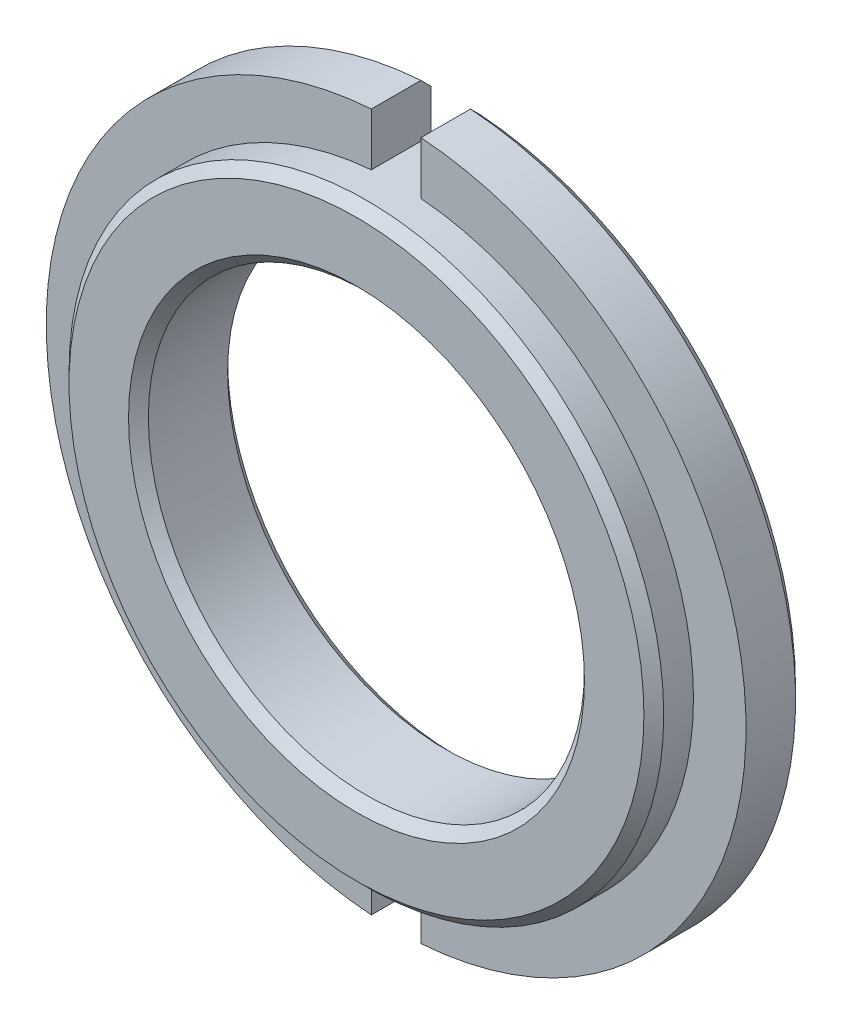
ISO-10303-21;
HEADER;
FILE_DESCRIPTION(('STEP AP214'),'2;1');
FILE_NAME('part.step','',(''),(''),'','','');
FILE_SCHEMA(('AUTOMOTIVE_DESIGN { 1 0 10303 214 1 1 1 1 }'));
ENDSEC;
DATA;
#1=APPLICATION_CONTEXT('core data for automotive mechanical design processes');
#2=APPLICATION_PROTOCOL_DEFINITION('international standard','automotive_design',2000,#1);
#3=PRODUCT_CONTEXT('',#1,'mechanical');
#4=PRODUCT('Part','Part','',(#3));
#5=PRODUCT_RELATED_PRODUCT_CATEGORY('part','',(#4));
#6=PRODUCT_DEFINITION_FORMATION('','',#4);
#7=PRODUCT_DEFINITION_CONTEXT('part definition',#1,'design');
#8=PRODUCT_DEFINITION('design','',#6,#7);
#9=PRODUCT_DEFINITION_SHAPE('','',#8);
#10=(LENGTH_UNIT() NAMED_UNIT(*) SI_UNIT(.MILLI.,.METRE.));
#11=(NAMED_UNIT(*) PLANE_ANGLE_UNIT() SI_UNIT($,.RADIAN.));
#12=(NAMED_UNIT(*) SI_UNIT($,.STERADIAN.) SOLID_ANGLE_UNIT());
#13=UNCERTAINTY_MEASURE_WITH_UNIT(LENGTH_MEASURE(1.E-05),#10,'distance_accuracy_value','');
#14=(GEOMETRIC_REPRESENTATION_CONTEXT(3) GLOBAL_UNCERTAINTY_ASSIGNED_CONTEXT((#13)) GLOBAL_UNIT_ASSIGNED_CONTEXT((#10,
#11,#12)) REPRESENTATION_CONTEXT('',''));
#15=CARTESIAN_POINT('',(0.,0.,0.));
#16=DIRECTION('',(0.,0.,1.));
#17=DIRECTION('',(1.,0.,0.));
#18=AXIS2_PLACEMENT_3D('',#15,#16,#17);
#19=CARTESIAN_POINT('',(0.,0.,5.));
#20=DIRECTION('',(0.,0.,-1.));
#21=DIRECTION('',(-1.,0.,0.));
#22=AXIS2_PLACEMENT_3D('',#19,#20,#21);
#23=CYLINDRICAL_SURFACE('',#22,17.65);
#24=DIRECTION('',(0.,0.,1.));
#25=VECTOR('',#24,1.);
#26=CARTESIAN_POINT('',(1.25,-17.6056809013455,-0.00100000000000013));
#27=LINE('',#26,#25);
#28=CARTESIAN_POINT('',(1.25,-17.6056809013455,0.500000000000005));
#29=VERTEX_POINT('',#28);
#30=CARTESIAN_POINT('',(1.25,-17.6056809013455,3.));
#31=VERTEX_POINT('',#30);
#32=EDGE_CURVE('E148',#29,#31,#27,.T.);
#33=ORIENTED_EDGE('',*,*,#32,.F.);
#34=CARTESIAN_POINT('',(0.,0.,0.5));
#35=DIRECTION('',(0.,0.,1.));
#36=DIRECTION('',(1.,0.,0.));
#37=AXIS2_PLACEMENT_3D('',#34,#35,#36);
#38=CIRCLE('',#37,17.65);
#39=CARTESIAN_POINT('',(1.25000000000001,17.6056809013455,0.500000000000005));
#40=VERTEX_POINT('',#39);
#41=EDGE_CURVE('E192',#29,#40,#38,.T.);
#42=ORIENTED_EDGE('',*,*,#41,.T.);
#43=DIRECTION('',(0.,0.,1.));
#44=VECTOR('',#43,1.);
#45=CARTESIAN_POINT('',(1.25000000000001,17.6056809013455,-0.00100000000000013));
#46=LINE('',#45,#44);
#47=CARTESIAN_POINT('',(1.25000000000001,17.6056809013455,3.));
#48=VERTEX_POINT('',#47);
#49=EDGE_CURVE('E166',#40,#48,#46,.T.);
#50=ORIENTED_EDGE('',*,*,#49,.T.);
#51=CARTESIAN_POINT('',(0.,0.,3.));
#52=DIRECTION('',(0.,0.,1.));
#53=DIRECTION('',(1.,0.,0.));
#54=AXIS2_PLACEMENT_3D('',#51,#52,#53);
#55=CIRCLE('',#54,17.65);
#56=EDGE_CURVE('E173',#31,#48,#55,.T.);
#57=ORIENTED_EDGE('',*,*,#56,.F.);
#58=EDGE_LOOP('',(#33,#42,#50,#57));
#59=FACE_BOUND('',#58,.T.);
#60=ADVANCED_FACE('F32',(#59),#23,.T.);
#61=CARTESIAN_POINT('',(0.,0.,3.));
#62=DIRECTION('',(0.,0.,1.));
#63=DIRECTION('',(1.,0.,0.));
#64=AXIS2_PLACEMENT_3D('',#61,#62,#63);
#65=PLANE('',#64);
#66=DIRECTION('',(0.,1.,0.));
#67=VECTOR('',#66,1.);
#68=CARTESIAN_POINT('',(1.25,-14.9478259288767,3.));
#69=LINE('',#68,#67);
#70=CARTESIAN_POINT('',(1.25,-14.9478259288767,3.));
#71=VERTEX_POINT('',#70);
#72=EDGE_CURVE('E135',#31,#71,#69,.T.);
#73=ORIENTED_EDGE('',*,*,#72,.F.);
#74=ORIENTED_EDGE('',*,*,#56,.T.);
#75=DIRECTION('',(0.,1.,0.));
#76=VECTOR('',#75,1.);
#77=CARTESIAN_POINT('',(1.25,17.6056809013455,3.));
#78=LINE('',#77,#76);
#79=CARTESIAN_POINT('',(1.25,14.9478259288767,3.));
#80=VERTEX_POINT('',#79);
#81=EDGE_CURVE('E155',#80,#48,#78,.T.);
#82=ORIENTED_EDGE('',*,*,#81,.F.);
#83=CARTESIAN_POINT('',(0.,0.,3.));
#84=DIRECTION('',(0.,0.,1.));
#85=DIRECTION('',(1.,0.,0.));
#86=AXIS2_PLACEMENT_3D('',#83,#84,#85);
#87=CIRCLE('',#86,15.);
#88=EDGE_CURVE('E171',#71,#80,#87,.T.);
#89=ORIENTED_EDGE('',*,*,#88,.F.);
#90=EDGE_LOOP('',(#73,#74,#82,#89));
#91=FACE_BOUND('',#90,.T.);
#92=ADVANCED_FACE('F225',(#91),#65,.T.);
#93=CARTESIAN_POINT('',(0.,0.,5.));
#94=DIRECTION('',(0.,0.,1.));
#95=DIRECTION('',(1.,0.,0.));
#96=AXIS2_PLACEMENT_3D('',#93,#94,#95);
#97=PLANE('',#96);
#98=CARTESIAN_POINT('',(0.,0.,5.));
#99=DIRECTION('',(0.,0.,1.));
#100=DIRECTION('',(1.,0.,0.));
#101=AXIS2_PLACEMENT_3D('',#98,#99,#100);
#102=CIRCLE('',#101,11.5);
#103=CARTESIAN_POINT('',(11.5,0.,5.));
#104=VERTEX_POINT('',#103);
#105=EDGE_CURVE('E186',#104,#104,#102,.F.);
#106=ORIENTED_EDGE('',*,*,#105,.T.);
#107=EDGE_LOOP('',(#106));
#108=FACE_BOUND('',#107,.T.);
#109=CARTESIAN_POINT('',(0.,0.,5.));
#110=DIRECTION('',(0.,0.,1.));
#111=DIRECTION('',(1.,0.,0.));
#112=AXIS2_PLACEMENT_3D('',#109,#110,#111);
#113=CIRCLE('',#112,14.5);
#114=CARTESIAN_POINT('',(14.5,0.,5.));
#115=VERTEX_POINT('',#114);
#116=EDGE_CURVE('E183',#115,#115,#113,.T.);
#117=ORIENTED_EDGE('',*,*,#116,.T.);
#118=EDGE_LOOP('',(#117));
#119=FACE_BOUND('',#118,.T.);
#120=ADVANCED_FACE('F229',(#108,#119),#97,.T.);
#121=DIRECTION('',(0.,0.,1.));
#122=VECTOR('',#121,1.);
#123=CARTESIAN_POINT('',(-1.25,17.6056809013455,-0.00100000000000013));
#124=LINE('',#123,#122);
#125=CARTESIAN_POINT('',(-1.25,17.6056809013455,0.500000000000005));
#126=VERTEX_POINT('',#125);
#127=CARTESIAN_POINT('',(-1.25,17.6056809013455,3.));
#128=VERTEX_POINT('',#127);
#129=EDGE_CURVE('E164',#126,#128,#124,.T.);
#130=ORIENTED_EDGE('',*,*,#129,.F.);
#131=CARTESIAN_POINT('',(0.,0.,0.5));
#132=DIRECTION('',(0.,0.,1.));
#133=DIRECTION('',(1.,0.,0.));
#134=AXIS2_PLACEMENT_3D('',#131,#132,#133);
#135=CIRCLE('',#134,17.65);
#136=CARTESIAN_POINT('',(-1.25,-17.6056809013455,0.500000000000005));
#137=VERTEX_POINT('',#136);
#138=EDGE_CURVE('E275',#126,#137,#135,.T.);
#139=ORIENTED_EDGE('',*,*,#138,.T.);
#140=DIRECTION('',(0.,0.,1.));
#141=VECTOR('',#140,1.);
#142=CARTESIAN_POINT('',(-1.25,-17.6056809013455,-0.00100000000000013));
#143=LINE('',#142,#141);
#144=CARTESIAN_POINT('',(-1.25,-17.6056809013455,3.));
#145=VERTEX_POINT('',#144);
#146=EDGE_CURVE('E134',#137,#145,#143,.T.);
#147=ORIENTED_EDGE('',*,*,#146,.T.);
#148=EDGE_CURVE('E174',#128,#145,#55,.T.);
#149=ORIENTED_EDGE('',*,*,#148,.F.);
#150=EDGE_LOOP('',(#130,#139,#147,#149));
#151=FACE_BOUND('',#150,.T.);
#152=ADVANCED_FACE('F232',(#151),#23,.T.);
#153=CARTESIAN_POINT('',(0.,0.,0.));
#154=DIRECTION('',(0.,0.,1.));
#155=DIRECTION('',(1.,0.,0.));
#156=AXIS2_PLACEMENT_3D('',#153,#154,#155);
#157=PLANE('',#156);
#158=CARTESIAN_POINT('',(0.,0.,0.));
#159=DIRECTION('',(0.,0.,1.));
#160=DIRECTION('',(1.,0.,0.));
#161=AXIS2_PLACEMENT_3D('',#158,#159,#160);
#162=CIRCLE('',#161,11.5);
#163=CARTESIAN_POINT('',(11.5,0.,0.));
#164=VERTEX_POINT('',#163);
#165=EDGE_CURVE('E203',#164,#164,#162,.T.);
#166=ORIENTED_EDGE('',*,*,#165,.T.);
#167=EDGE_LOOP('',(#166));
#168=FACE_BOUND('',#167,.T.);
#169=DIRECTION('',(0.,-1.,0.));
#170=VECTOR('',#169,1.);
#171=CARTESIAN_POINT('',(1.25,17.6056809013455,0.));
#172=LINE('',#171,#170);
#173=CARTESIAN_POINT('',(1.25,17.1043854025802,0.));
#174=VERTEX_POINT('',#173);
#175=CARTESIAN_POINT('',(1.25,14.9478259288767,0.));
#176=VERTEX_POINT('',#175);
#177=EDGE_CURVE('E163',#174,#176,#172,.T.);
#178=ORIENTED_EDGE('',*,*,#177,.F.);
#179=CARTESIAN_POINT('',(0.,0.,0.));
#180=DIRECTION('',(0.,0.,1.));
#181=DIRECTION('',(1.,0.,0.));
#182=AXIS2_PLACEMENT_3D('',#179,#180,#181);
#183=CIRCLE('',#182,17.15);
#184=CARTESIAN_POINT('',(1.25,-17.1043854025802,0.));
#185=VERTEX_POINT('',#184);
#186=EDGE_CURVE('E269',#174,#185,#183,.F.);
#187=ORIENTED_EDGE('',*,*,#186,.T.);
#188=DIRECTION('',(0.,-1.,0.));
#189=VECTOR('',#188,1.);
#190=CARTESIAN_POINT('',(1.25,-14.9478259288767,0.));
#191=LINE('',#190,#189);
#192=CARTESIAN_POINT('',(1.25,-14.9478259288767,0.));
#193=VERTEX_POINT('',#192);
#194=EDGE_CURVE('E140',#193,#185,#191,.T.);
#195=ORIENTED_EDGE('',*,*,#194,.F.);
#196=CARTESIAN_POINT('',(0.,0.,0.));
#197=DIRECTION('',(0.,0.,1.));
#198=DIRECTION('',(1.,0.,0.));
#199=AXIS2_PLACEMENT_3D('',#196,#197,#198);
#200=CIRCLE('',#199,15.);
#201=CARTESIAN_POINT('',(-1.25,-14.9478259288767,0.));
#202=VERTEX_POINT('',#201);
#203=EDGE_CURVE('E129',#202,#193,#200,.T.);
#204=ORIENTED_EDGE('',*,*,#203,.F.);
#205=DIRECTION('',(0.,1.,0.));
#206=VECTOR('',#205,1.);
#207=CARTESIAN_POINT('',(-1.25,-14.9478259288767,0.));
#208=LINE('',#207,#206);
#209=CARTESIAN_POINT('',(-1.25,-17.1043854025802,0.));
#210=VERTEX_POINT('',#209);
#211=EDGE_CURVE('E112',#210,#202,#208,.T.);
#212=ORIENTED_EDGE('',*,*,#211,.F.);
#213=CARTESIAN_POINT('',(0.,0.,0.));
#214=DIRECTION('',(0.,0.,1.));
#215=DIRECTION('',(1.,0.,0.));
#216=AXIS2_PLACEMENT_3D('',#213,#214,#215);
#217=CIRCLE('',#216,17.15);
#218=CARTESIAN_POINT('',(-1.25,17.1043854025802,0.));
#219=VERTEX_POINT('',#218);
#220=EDGE_CURVE('E278',#210,#219,#217,.F.);
#221=ORIENTED_EDGE('',*,*,#220,.T.);
#222=DIRECTION('',(0.,1.,0.));
#223=VECTOR('',#222,1.);
#224=CARTESIAN_POINT('',(-1.25,17.6056809013455,0.));
#225=LINE('',#224,#223);
#226=CARTESIAN_POINT('',(-1.25,14.9478259288767,0.));
#227=VERTEX_POINT('',#226);
#228=EDGE_CURVE('E153',#227,#219,#225,.T.);
#229=ORIENTED_EDGE('',*,*,#228,.F.);
#230=CARTESIAN_POINT('',(0.,0.,0.));
#231=DIRECTION('',(0.,0.,1.));
#232=DIRECTION('',(1.,0.,0.));
#233=AXIS2_PLACEMENT_3D('',#230,#231,#232);
#234=CIRCLE('',#233,15.);
#235=EDGE_CURVE('E121',#176,#227,#234,.T.);
#236=ORIENTED_EDGE('',*,*,#235,.F.);
#237=EDGE_LOOP('',(#178,#187,#195,#204,#212,#221,#229,#236));
#238=FACE_BOUND('',#237,.T.);
#239=ADVANCED_FACE('F138',(#168,#238),#157,.F.);
#240=CARTESIAN_POINT('',(0.,0.,5.));
#241=DIRECTION('',(0.,0.,-1.));
#242=DIRECTION('',(-1.,0.,0.));
#243=AXIS2_PLACEMENT_3D('',#240,#241,#242);
#244=CYLINDRICAL_SURFACE('',#243,11.);
#245=CARTESIAN_POINT('',(0.,0.,4.49999999999999));
#246=DIRECTION('',(0.,0.,1.));
#247=DIRECTION('',(1.,0.,0.));
#248=AXIS2_PLACEMENT_3D('',#245,#246,#247);
#249=CIRCLE('',#248,11.);
#250=CARTESIAN_POINT('',(11.,0.,4.49999999999999));
#251=VERTEX_POINT('',#250);
#252=EDGE_CURVE('E180',#251,#251,#249,.T.);
#253=ORIENTED_EDGE('',*,*,#252,.T.);
#254=EDGE_LOOP('',(#253));
#255=FACE_BOUND('',#254,.T.);
#256=CARTESIAN_POINT('',(0.,0.,0.499999999999995));
#257=DIRECTION('',(0.,0.,1.));
#258=DIRECTION('',(1.,0.,0.));
#259=AXIS2_PLACEMENT_3D('',#256,#257,#258);
#260=CIRCLE('',#259,11.);
#261=CARTESIAN_POINT('',(11.,0.,0.499999999999995));
#262=VERTEX_POINT('',#261);
#263=EDGE_CURVE('E177',#262,#262,#260,.F.);
#264=ORIENTED_EDGE('',*,*,#263,.T.);
#265=EDGE_LOOP('',(#264));
#266=FACE_BOUND('',#265,.T.);
#267=ADVANCED_FACE('F223',(#255,#266),#244,.F.);
#268=DIRECTION('',(0.,-1.,0.));
#269=VECTOR('',#268,1.);
#270=CARTESIAN_POINT('',(-1.25,-14.9478259288767,3.));
#271=LINE('',#270,#269);
#272=CARTESIAN_POINT('',(-1.25,-14.9478259288767,3.));
#273=VERTEX_POINT('',#272);
#274=EDGE_CURVE('E142',#273,#145,#271,.T.);
#275=ORIENTED_EDGE('',*,*,#274,.F.);
#276=CARTESIAN_POINT('',(-1.25,14.9478259288767,3.));
#277=VERTEX_POINT('',#276);
#278=EDGE_CURVE('E133',#277,#273,#87,.T.);
#279=ORIENTED_EDGE('',*,*,#278,.F.);
#280=DIRECTION('',(0.,-1.,0.));
#281=VECTOR('',#280,1.);
#282=CARTESIAN_POINT('',(-1.25,17.6056809013455,3.));
#283=LINE('',#282,#281);
#284=EDGE_CURVE('E158',#128,#277,#283,.T.);
#285=ORIENTED_EDGE('',*,*,#284,.F.);
#286=ORIENTED_EDGE('',*,*,#148,.T.);
#287=EDGE_LOOP('',(#275,#279,#285,#286));
#288=FACE_BOUND('',#287,.T.);
#289=ADVANCED_FACE('F219',(#288),#65,.T.);
#290=CARTESIAN_POINT('',(0.,0.,3.));
#291=DIRECTION('',(0.,0.,1.));
#292=DIRECTION('',(1.,0.,0.));
#293=AXIS2_PLACEMENT_3D('',#290,#291,#292);
#294=CYLINDRICAL_SURFACE('',#293,15.);
#295=CARTESIAN_POINT('',(0.,0.,4.5));
#296=DIRECTION('',(0.,0.,1.));
#297=DIRECTION('',(1.,0.,0.));
#298=AXIS2_PLACEMENT_3D('',#295,#296,#297);
#299=CIRCLE('',#298,15.);
#300=CARTESIAN_POINT('',(15.,0.,4.5));
#301=VERTEX_POINT('',#300);
#302=EDGE_CURVE('E189',#301,#301,#299,.F.);
#303=ORIENTED_EDGE('',*,*,#302,.T.);
#304=EDGE_LOOP('',(#303));
#305=FACE_BOUND('',#304,.T.);
#306=ORIENTED_EDGE('',*,*,#278,.T.);
#307=DIRECTION('',(0.,0.,1.));
#308=VECTOR('',#307,1.);
#309=CARTESIAN_POINT('',(-1.25,-14.9478259288767,-0.00100000000000013));
#310=LINE('',#309,#308);
#311=EDGE_CURVE('E117',#202,#273,#310,.T.);
#312=ORIENTED_EDGE('',*,*,#311,.F.);
#313=ORIENTED_EDGE('',*,*,#203,.T.);
#314=DIRECTION('',(0.,0.,1.));
#315=VECTOR('',#314,1.);
#316=CARTESIAN_POINT('',(1.25,-14.9478259288767,-0.00100000000000013));
#317=LINE('',#316,#315);
#318=EDGE_CURVE('E122',#193,#71,#317,.T.);
#319=ORIENTED_EDGE('',*,*,#318,.T.);
#320=ORIENTED_EDGE('',*,*,#88,.T.);
#321=DIRECTION('',(0.,0.,1.));
#322=VECTOR('',#321,1.);
#323=CARTESIAN_POINT('',(1.25,14.9478259288767,-0.00100000000000013));
#324=LINE('',#323,#322);
#325=EDGE_CURVE('E160',#176,#80,#324,.T.);
#326=ORIENTED_EDGE('',*,*,#325,.F.);
#327=ORIENTED_EDGE('',*,*,#235,.T.);
#328=DIRECTION('',(0.,0.,1.));
#329=VECTOR('',#328,1.);
#330=CARTESIAN_POINT('',(-1.25,14.9478259288767,-0.00100000000000013));
#331=LINE('',#330,#329);
#332=EDGE_CURVE('E161',#227,#277,#331,.T.);
#333=ORIENTED_EDGE('',*,*,#332,.T.);
#334=EDGE_LOOP('',(#306,#312,#313,#319,#320,#326,#327,#333));
#335=FACE_BOUND('',#334,.T.);
#336=ADVANCED_FACE('F127',(#305,#335),#294,.T.);
#337=CARTESIAN_POINT('',(-1.25,17.6056809013455,-0.00100000000000013));
#338=DIRECTION('',(-1.,0.,0.));
#339=DIRECTION('',(0.,0.,1.));
#340=AXIS2_PLACEMENT_3D('',#337,#338,#339);
#341=PLANE('',#340);
#342=ORIENTED_EDGE('',*,*,#228,.T.);
#343=CARTESIAN_POINT('',(-1.25,17.1043854025802,0.));
#344=CARTESIAN_POINT('',(-1.25,17.1879377586314,0.0833302190288848));
#345=CARTESIAN_POINT('',(-1.25,17.2714885615543,0.166661995210202));
#346=CARTESIAN_POINT('',(-1.25,17.4385870611427,0.333328661876869));
#347=CARTESIAN_POINT('',(-1.25,17.5221347578082,0.416663552362218));
#348=CARTESIAN_POINT('',(-1.25,17.6056809013454,0.5));
#349=B_SPLINE_CURVE_WITH_KNOTS('',3,(#343,#344,#345,#346,#347,#348),.UNSPECIFIED.,.F.,.F.,(4,2,
4),(0.,0.354011714940833,0.708023429878131),.UNSPECIFIED.);
#350=EDGE_CURVE('E11',#219,#126,#349,.T.);
#351=ORIENTED_EDGE('',*,*,#350,.T.);
#352=ORIENTED_EDGE('',*,*,#129,.T.);
#353=ORIENTED_EDGE('',*,*,#284,.T.);
#354=ORIENTED_EDGE('',*,*,#332,.F.);
#355=EDGE_LOOP('',(#342,#351,#352,#353,#354));
#356=FACE_BOUND('',#355,.T.);
#357=ADVANCED_FACE('F213',(#356),#341,.F.);
#358=CARTESIAN_POINT('',(1.25,17.6056809013455,-0.00100000000000013));
#359=DIRECTION('',(1.,0.,0.));
#360=DIRECTION('',(0.,0.,-1.));
#361=AXIS2_PLACEMENT_3D('',#358,#359,#360);
#362=PLANE('',#361);
#363=ORIENTED_EDGE('',*,*,#49,.F.);
#364=CARTESIAN_POINT('',(1.25000000000001,17.6056809013454,0.5));
#365=CARTESIAN_POINT('',(1.25000000000001,17.5221347578082,0.416663552362219));
#366=CARTESIAN_POINT('',(1.25,17.4385870611427,0.333328661876869));
#367=CARTESIAN_POINT('',(1.25,17.2714885615543,0.166661995210202));
#368=CARTESIAN_POINT('',(1.25,17.1879377586314,0.0833302190288852));
#369=CARTESIAN_POINT('',(1.25,17.1043854025802,0.));
#370=B_SPLINE_CURVE_WITH_KNOTS('',3,(#364,#365,#366,#367,#368,#369),.UNSPECIFIED.,.F.,.F.,(4,2,
4),(0.,0.354011714937298,0.708023429878131),.UNSPECIFIED.);
#371=EDGE_CURVE('E195',#40,#174,#370,.T.);
#372=ORIENTED_EDGE('',*,*,#371,.T.);
#373=ORIENTED_EDGE('',*,*,#177,.T.);
#374=ORIENTED_EDGE('',*,*,#325,.T.);
#375=ORIENTED_EDGE('',*,*,#81,.T.);
#376=EDGE_LOOP('',(#363,#372,#373,#374,#375));
#377=FACE_BOUND('',#376,.T.);
#378=ADVANCED_FACE('F208',(#377),#362,.F.);
#379=CARTESIAN_POINT('',(1.25,-14.9478259288767,-0.00100000000000013));
#380=DIRECTION('',(1.,0.,0.));
#381=DIRECTION('',(0.,0.,-1.));
#382=AXIS2_PLACEMENT_3D('',#379,#380,#381);
#383=PLANE('',#382);
#384=ORIENTED_EDGE('',*,*,#194,.T.);
#385=CARTESIAN_POINT('',(1.25,-17.1043854025802,0.));
#386=CARTESIAN_POINT('',(1.25,-17.1879377586314,0.0833302190288848));
#387=CARTESIAN_POINT('',(1.25,-17.2714885615543,0.166661995210202));
#388=CARTESIAN_POINT('',(1.25,-17.4385870611427,0.333328661876869));
#389=CARTESIAN_POINT('',(1.25,-17.5221347578082,0.416663552362218));
#390=CARTESIAN_POINT('',(1.25,-17.6056809013454,0.5));
#391=B_SPLINE_CURVE_WITH_KNOTS('',3,(#385,#386,#387,#388,#389,#390),.UNSPECIFIED.,.F.,.F.,(4,2,
4),(0.,0.354011714940833,0.708023429878131),.UNSPECIFIED.);
#392=EDGE_CURVE('E268',#185,#29,#391,.T.);
#393=ORIENTED_EDGE('',*,*,#392,.T.);
#394=ORIENTED_EDGE('',*,*,#32,.T.);
#395=ORIENTED_EDGE('',*,*,#72,.T.);
#396=ORIENTED_EDGE('',*,*,#318,.F.);
#397=EDGE_LOOP('',(#384,#393,#394,#395,#396));
#398=FACE_BOUND('',#397,.T.);
#399=ADVANCED_FACE('F212',(#398),#383,.F.);
#400=CARTESIAN_POINT('',(-1.25,-14.9478259288767,-0.00100000000000013));
#401=DIRECTION('',(-1.,0.,0.));
#402=DIRECTION('',(0.,0.,1.));
#403=AXIS2_PLACEMENT_3D('',#400,#401,#402);
#404=PLANE('',#403);
#405=ORIENTED_EDGE('',*,*,#146,.F.);
#406=CARTESIAN_POINT('',(-1.25,-17.6056809013454,0.5));
#407=CARTESIAN_POINT('',(-1.25,-17.5221347578082,0.416663552362219));
#408=CARTESIAN_POINT('',(-1.25,-17.4385870611427,0.333328661876869));
#409=CARTESIAN_POINT('',(-1.25,-17.2714885615543,0.166661995210202));
#410=CARTESIAN_POINT('',(-1.25,-17.1879377586314,0.0833302190288852));
#411=CARTESIAN_POINT('',(-1.25,-17.1043854025802,0.));
#412=B_SPLINE_CURVE_WITH_KNOTS('',3,(#406,#407,#408,#409,#410,#411),.UNSPECIFIED.,.F.,.F.,(4,2,
4),(0.,0.354011714937298,0.70802342987813),.UNSPECIFIED.);
#413=EDGE_CURVE('E45',#137,#210,#412,.T.);
#414=ORIENTED_EDGE('',*,*,#413,.T.);
#415=ORIENTED_EDGE('',*,*,#211,.T.);
#416=ORIENTED_EDGE('',*,*,#311,.T.);
#417=ORIENTED_EDGE('',*,*,#274,.T.);
#418=EDGE_LOOP('',(#405,#414,#415,#416,#417));
#419=FACE_BOUND('',#418,.T.);
#420=ADVANCED_FACE('F115',(#419),#404,.F.);
#421=CARTESIAN_POINT('',(0.,0.,4.49999999999999));
#422=DIRECTION('',(0.,0.,1.));
#423=DIRECTION('',(1.,0.,0.));
#424=AXIS2_PLACEMENT_3D('',#421,#422,#423);
#425=CONICAL_SURFACE('',#424,11.,0.785398163397447);
#426=ORIENTED_EDGE('',*,*,#105,.F.);
#427=EDGE_LOOP('',(#426));
#428=FACE_BOUND('',#427,.T.);
#429=ORIENTED_EDGE('',*,*,#252,.F.);
#430=EDGE_LOOP('',(#429));
#431=FACE_BOUND('',#430,.T.);
#432=ADVANCED_FACE('F240',(#428,#431),#425,.F.);
#433=CARTESIAN_POINT('',(0.,0.,5.));
#434=DIRECTION('',(0.,0.,-1.));
#435=DIRECTION('',(-1.,0.,0.));
#436=AXIS2_PLACEMENT_3D('',#433,#434,#435);
#437=CONICAL_SURFACE('',#436,14.5,0.785398163397448);
#438=ORIENTED_EDGE('',*,*,#302,.F.);
#439=EDGE_LOOP('',(#438));
#440=FACE_BOUND('',#439,.T.);
#441=ORIENTED_EDGE('',*,*,#116,.F.);
#442=EDGE_LOOP('',(#441));
#443=FACE_BOUND('',#442,.T.);
#444=ADVANCED_FACE('F242',(#440,#443),#437,.T.);
#445=CARTESIAN_POINT('',(0.,0.,0.5));
#446=DIRECTION('',(0.,0.,1.));
#447=DIRECTION('',(1.,0.,0.));
#448=AXIS2_PLACEMENT_3D('',#445,#446,#447);
#449=CONICAL_SURFACE('',#448,17.65,0.785398163397448);
#450=ORIENTED_EDGE('',*,*,#392,.F.);
#451=ORIENTED_EDGE('',*,*,#186,.F.);
#452=ORIENTED_EDGE('',*,*,#371,.F.);
#453=ORIENTED_EDGE('',*,*,#41,.F.);
#454=EDGE_LOOP('',(#450,#451,#452,#453));
#455=FACE_BOUND('',#454,.T.);
#456=ADVANCED_FACE('F205',(#455),#449,.T.);
#457=CARTESIAN_POINT('',(0.,0.,0.5));
#458=DIRECTION('',(0.,0.,1.));
#459=DIRECTION('',(1.,0.,0.));
#460=AXIS2_PLACEMENT_3D('',#457,#458,#459);
#461=CONICAL_SURFACE('',#460,17.65,0.785398163397448);
#462=ORIENTED_EDGE('',*,*,#350,.F.);
#463=ORIENTED_EDGE('',*,*,#220,.F.);
#464=ORIENTED_EDGE('',*,*,#413,.F.);
#465=ORIENTED_EDGE('',*,*,#138,.F.);
#466=EDGE_LOOP('',(#462,#463,#464,#465));
#467=FACE_BOUND('',#466,.T.);
#468=ADVANCED_FACE('F249',(#467),#461,.T.);
#469=CARTESIAN_POINT('',(0.,0.,0.));
#470=DIRECTION('',(0.,0.,-1.));
#471=DIRECTION('',(-1.,0.,0.));
#472=AXIS2_PLACEMENT_3D('',#469,#470,#471);
#473=CONICAL_SURFACE('',#472,11.5,0.785398163397447);
#474=ORIENTED_EDGE('',*,*,#263,.F.);
#475=EDGE_LOOP('',(#474));
#476=FACE_BOUND('',#475,.T.);
#477=ORIENTED_EDGE('',*,*,#165,.F.);
#478=EDGE_LOOP('',(#477));
#479=FACE_BOUND('',#478,.T.);
#480=ADVANCED_FACE('F34',(#476,#479),#473,.F.);
#481=CLOSED_SHELL('',(#60,#92,#120,#152,#239,#267,#289,#336,#357,#378,#399,#420,#432,#444,#456,
#468,#480));
#482=MANIFOLD_SOLID_BREP('B2',#481);
#483=ADVANCED_BREP_SHAPE_REPRESENTATION('',(#18,#482),#14);
#484=SHAPE_DEFINITION_REPRESENTATION(#9,#483);
ENDSEC;
END-ISO-10303-21;
